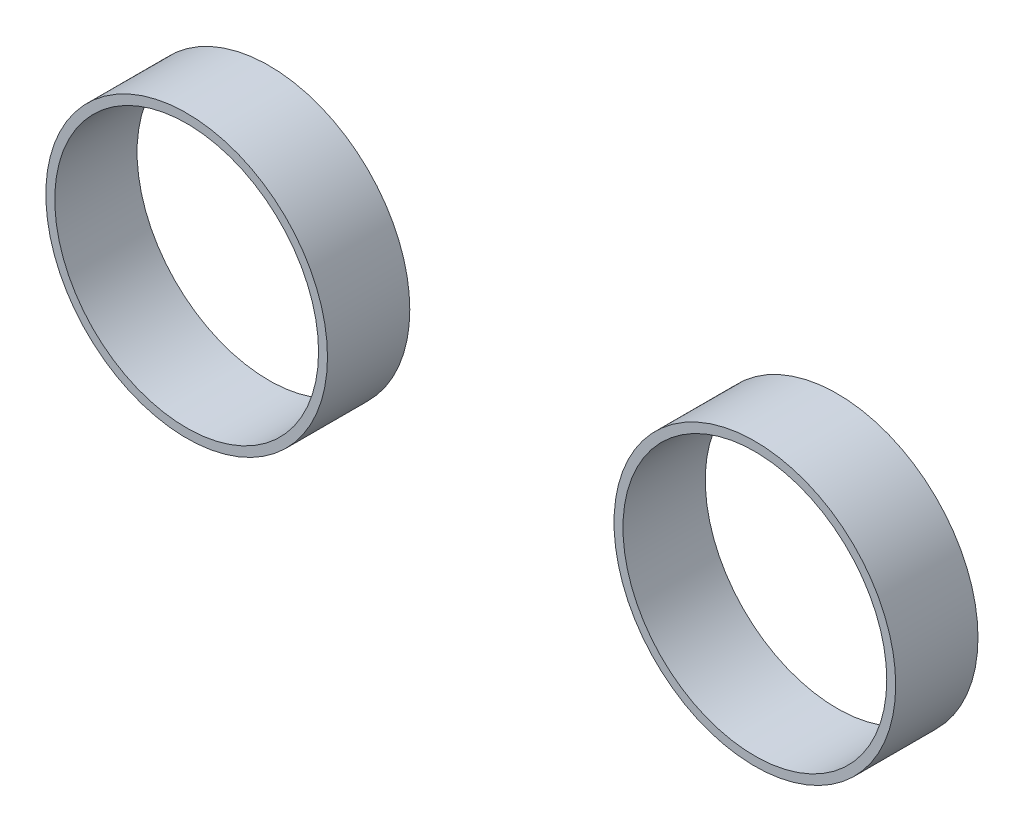
ISO-10303-21;
HEADER;
FILE_DESCRIPTION(('STEP AP214'),'2;1');
FILE_NAME('part.step','',(''),(''),'','','');
FILE_SCHEMA(('AUTOMOTIVE_DESIGN { 1 0 10303 214 1 1 1 1 }'));
ENDSEC;
DATA;
#1=APPLICATION_CONTEXT('core data for automotive mechanical design processes');
#2=APPLICATION_PROTOCOL_DEFINITION('international standard','automotive_design',2000,#1);
#3=PRODUCT_CONTEXT('',#1,'mechanical');
#4=PRODUCT('Part','Part','',(#3));
#5=PRODUCT_RELATED_PRODUCT_CATEGORY('part','',(#4));
#6=PRODUCT_DEFINITION_FORMATION('','',#4);
#7=PRODUCT_DEFINITION_CONTEXT('part definition',#1,'design');
#8=PRODUCT_DEFINITION('design','',#6,#7);
#9=PRODUCT_DEFINITION_SHAPE('','',#8);
#10=(LENGTH_UNIT() NAMED_UNIT(*) SI_UNIT(.MILLI.,.METRE.));
#11=(NAMED_UNIT(*) PLANE_ANGLE_UNIT() SI_UNIT($,.RADIAN.));
#12=(NAMED_UNIT(*) SI_UNIT($,.STERADIAN.) SOLID_ANGLE_UNIT());
#13=UNCERTAINTY_MEASURE_WITH_UNIT(LENGTH_MEASURE(1.E-05),#10,'distance_accuracy_value','');
#14=(GEOMETRIC_REPRESENTATION_CONTEXT(3) GLOBAL_UNCERTAINTY_ASSIGNED_CONTEXT((#13)) GLOBAL_UNIT_ASSIGNED_CONTEXT((#10,
#11,#12)) REPRESENTATION_CONTEXT('',''));
#15=CARTESIAN_POINT('',(0.,0.,0.));
#16=DIRECTION('',(0.,0.,1.));
#17=DIRECTION('',(1.,0.,0.));
#18=AXIS2_PLACEMENT_3D('',#15,#16,#17);
#19=CARTESIAN_POINT('',(1715.98047275872,-423.382336201492,40.56));
#20=DIRECTION('',(0.,0.,1.));
#21=DIRECTION('',(1.,0.,0.));
#22=AXIS2_PLACEMENT_3D('',#19,#20,#21);
#23=PLANE('',#22);
#24=CARTESIAN_POINT('',(1715.98047275872,-423.382336201492,40.56));
#25=DIRECTION('',(0.,0.,1.));
#26=DIRECTION('',(1.,0.,0.));
#27=AXIS2_PLACEMENT_3D('',#24,#25,#26);
#28=CIRCLE('',#27,69.3999999999999);
#29=CARTESIAN_POINT('',(1785.38047275872,-423.382336201492,40.56));
#30=VERTEX_POINT('',#29);
#31=EDGE_CURVE('E62',#30,#30,#28,.T.);
#32=ORIENTED_EDGE('',*,*,#31,.T.);
#33=EDGE_LOOP('',(#32));
#34=FACE_BOUND('',#33,.T.);
#35=CARTESIAN_POINT('',(1715.98047275872,-423.382336201492,40.56));
#36=DIRECTION('',(0.,0.,1.));
#37=DIRECTION('',(1.,0.,0.));
#38=AXIS2_PLACEMENT_3D('',#35,#36,#37);
#39=CIRCLE('',#38,64.9999999999999);
#40=CARTESIAN_POINT('',(1780.98047275872,-423.382336201492,40.56));
#41=VERTEX_POINT('',#40);
#42=EDGE_CURVE('E53',#41,#41,#39,.T.);
#43=ORIENTED_EDGE('',*,*,#42,.F.);
#44=EDGE_LOOP('',(#43));
#45=FACE_BOUND('',#44,.T.);
#46=ADVANCED_FACE('F49',(#34,#45),#23,.T.);
#47=CARTESIAN_POINT('',(1715.98047275872,-423.382336201492,0.));
#48=DIRECTION('',(0.,0.,1.));
#49=DIRECTION('',(1.,0.,0.));
#50=AXIS2_PLACEMENT_3D('',#47,#48,#49);
#51=PLANE('',#50);
#52=CARTESIAN_POINT('',(1715.98047275872,-423.382336201492,0.));
#53=DIRECTION('',(0.,0.,1.));
#54=DIRECTION('',(1.,0.,0.));
#55=AXIS2_PLACEMENT_3D('',#52,#53,#54);
#56=CIRCLE('',#55,69.3999999999999);
#57=CARTESIAN_POINT('',(1785.38047275872,-423.382336201492,0.));
#58=VERTEX_POINT('',#57);
#59=EDGE_CURVE('E60',#58,#58,#56,.T.);
#60=ORIENTED_EDGE('',*,*,#59,.F.);
#61=EDGE_LOOP('',(#60));
#62=FACE_BOUND('',#61,.T.);
#63=CARTESIAN_POINT('',(1715.98047275872,-423.382336201492,0.));
#64=DIRECTION('',(0.,0.,1.));
#65=DIRECTION('',(1.,0.,0.));
#66=AXIS2_PLACEMENT_3D('',#63,#64,#65);
#67=CIRCLE('',#66,64.9999999999999);
#68=CARTESIAN_POINT('',(1780.98047275872,-423.382336201492,0.));
#69=VERTEX_POINT('',#68);
#70=EDGE_CURVE('E11',#69,#69,#67,.T.);
#71=ORIENTED_EDGE('',*,*,#70,.T.);
#72=EDGE_LOOP('',(#71));
#73=FACE_BOUND('',#72,.T.);
#74=ADVANCED_FACE('F70',(#62,#73),#51,.F.);
#75=CARTESIAN_POINT('',(1715.98047275872,-423.382336201492,40.56));
#76=DIRECTION('',(0.,0.,-1.));
#77=DIRECTION('',(-1.,0.,0.));
#78=AXIS2_PLACEMENT_3D('',#75,#76,#77);
#79=CYLINDRICAL_SURFACE('',#78,69.3999999999999);
#80=ORIENTED_EDGE('',*,*,#31,.F.);
#81=EDGE_LOOP('',(#80));
#82=FACE_BOUND('',#81,.T.);
#83=ORIENTED_EDGE('',*,*,#59,.T.);
#84=EDGE_LOOP('',(#83));
#85=FACE_BOUND('',#84,.T.);
#86=ADVANCED_FACE('F68',(#82,#85),#79,.T.);
#87=CARTESIAN_POINT('',(1715.98047275872,-423.382336201492,40.56));
#88=DIRECTION('',(0.,0.,-1.));
#89=DIRECTION('',(-1.,0.,0.));
#90=AXIS2_PLACEMENT_3D('',#87,#88,#89);
#91=CYLINDRICAL_SURFACE('',#90,64.9999999999999);
#92=ORIENTED_EDGE('',*,*,#42,.T.);
#93=EDGE_LOOP('',(#92));
#94=FACE_BOUND('',#93,.T.);
#95=ORIENTED_EDGE('',*,*,#70,.F.);
#96=EDGE_LOOP('',(#95));
#97=FACE_BOUND('',#96,.T.);
#98=ADVANCED_FACE('F51',(#94,#97),#91,.F.);
#99=CLOSED_SHELL('',(#46,#74,#86,#98));
#100=MANIFOLD_SOLID_BREP('B2',#99);
#101=CARTESIAN_POINT('',(1435.9804727587,-423.382336201578,40.56));
#102=DIRECTION('',(0.,0.,1.));
#103=DIRECTION('',(1.,0.,0.));
#104=AXIS2_PLACEMENT_3D('',#101,#102,#103);
#105=PLANE('',#104);
#106=CARTESIAN_POINT('',(1435.9804727587,-423.382336201578,40.56));
#107=DIRECTION('',(0.,0.,1.));
#108=DIRECTION('',(1.,0.,0.));
#109=AXIS2_PLACEMENT_3D('',#106,#107,#108);
#110=CIRCLE('',#109,69.3999999999999);
#111=CARTESIAN_POINT('',(1505.3804727587,-423.382336201578,40.56));
#112=VERTEX_POINT('',#111);
#113=EDGE_CURVE('E48',#112,#112,#110,.T.);
#114=ORIENTED_EDGE('',*,*,#113,.T.);
#115=EDGE_LOOP('',(#114));
#116=FACE_BOUND('',#115,.T.);
#117=CARTESIAN_POINT('',(1435.9804727587,-423.382336201578,40.56));
#118=DIRECTION('',(0.,0.,1.));
#119=DIRECTION('',(1.,0.,0.));
#120=AXIS2_PLACEMENT_3D('',#117,#118,#119);
#121=CIRCLE('',#120,64.9999999999999);
#122=CARTESIAN_POINT('',(1500.9804727587,-423.382336201578,40.56));
#123=VERTEX_POINT('',#122);
#124=EDGE_CURVE('E124',#123,#123,#121,.T.);
#125=ORIENTED_EDGE('',*,*,#124,.F.);
#126=EDGE_LOOP('',(#125));
#127=FACE_BOUND('',#126,.T.);
#128=ADVANCED_FACE('F111',(#116,#127),#105,.T.);
#129=CARTESIAN_POINT('',(1435.9804727587,-423.382336201578,0.));
#130=DIRECTION('',(0.,0.,1.));
#131=DIRECTION('',(1.,0.,0.));
#132=AXIS2_PLACEMENT_3D('',#129,#130,#131);
#133=PLANE('',#132);
#134=CARTESIAN_POINT('',(1435.9804727587,-423.382336201578,0.));
#135=DIRECTION('',(0.,0.,1.));
#136=DIRECTION('',(1.,0.,0.));
#137=AXIS2_PLACEMENT_3D('',#134,#135,#136);
#138=CIRCLE('',#137,69.3999999999999);
#139=CARTESIAN_POINT('',(1505.3804727587,-423.382336201578,0.));
#140=VERTEX_POINT('',#139);
#141=EDGE_CURVE('E115',#140,#140,#138,.T.);
#142=ORIENTED_EDGE('',*,*,#141,.F.);
#143=EDGE_LOOP('',(#142));
#144=FACE_BOUND('',#143,.T.);
#145=CARTESIAN_POINT('',(1435.9804727587,-423.382336201578,0.));
#146=DIRECTION('',(0.,0.,1.));
#147=DIRECTION('',(1.,0.,0.));
#148=AXIS2_PLACEMENT_3D('',#145,#146,#147);
#149=CIRCLE('',#148,64.9999999999999);
#150=CARTESIAN_POINT('',(1500.9804727587,-423.382336201578,0.));
#151=VERTEX_POINT('',#150);
#152=EDGE_CURVE('E126',#151,#151,#149,.T.);
#153=ORIENTED_EDGE('',*,*,#152,.T.);
#154=EDGE_LOOP('',(#153));
#155=FACE_BOUND('',#154,.T.);
#156=ADVANCED_FACE('F138',(#144,#155),#133,.F.);
#157=CARTESIAN_POINT('',(1435.9804727587,-423.382336201578,40.56));
#158=DIRECTION('',(0.,0.,-1.));
#159=DIRECTION('',(-1.,0.,0.));
#160=AXIS2_PLACEMENT_3D('',#157,#158,#159);
#161=CYLINDRICAL_SURFACE('',#160,69.3999999999999);
#162=ORIENTED_EDGE('',*,*,#113,.F.);
#163=EDGE_LOOP('',(#162));
#164=FACE_BOUND('',#163,.T.);
#165=ORIENTED_EDGE('',*,*,#141,.T.);
#166=EDGE_LOOP('',(#165));
#167=FACE_BOUND('',#166,.T.);
#168=ADVANCED_FACE('F113',(#164,#167),#161,.T.);
#169=CARTESIAN_POINT('',(1435.9804727587,-423.382336201578,40.56));
#170=DIRECTION('',(0.,0.,-1.));
#171=DIRECTION('',(-1.,0.,0.));
#172=AXIS2_PLACEMENT_3D('',#169,#170,#171);
#173=CYLINDRICAL_SURFACE('',#172,64.9999999999999);
#174=ORIENTED_EDGE('',*,*,#124,.T.);
#175=EDGE_LOOP('',(#174));
#176=FACE_BOUND('',#175,.T.);
#177=ORIENTED_EDGE('',*,*,#152,.F.);
#178=EDGE_LOOP('',(#177));
#179=FACE_BOUND('',#178,.T.);
#180=ADVANCED_FACE('F134',(#176,#179),#173,.F.);
#181=CLOSED_SHELL('',(#128,#156,#168,#180));
#182=MANIFOLD_SOLID_BREP('B6',#181);
#183=ADVANCED_BREP_SHAPE_REPRESENTATION('',(#18,#100,#182),#14);
#184=SHAPE_DEFINITION_REPRESENTATION(#9,#183);
ENDSEC;
END-ISO-10303-21;
